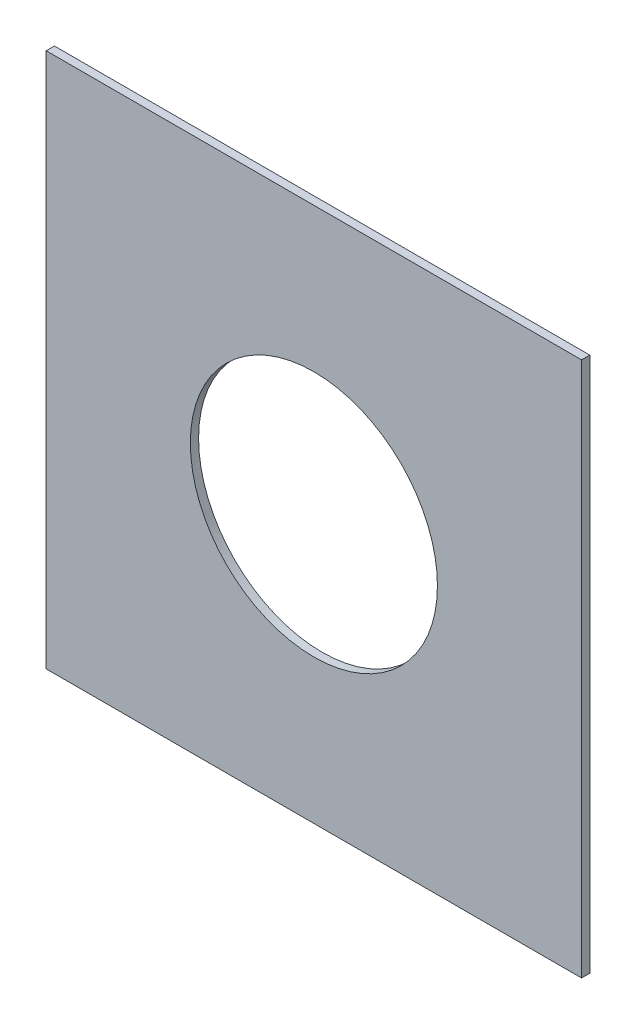
ISO-10303-21;
HEADER;
FILE_DESCRIPTION(('STEP AP214'),'2;1');
FILE_NAME('part.step','',(''),(''),'','','');
FILE_SCHEMA(('AUTOMOTIVE_DESIGN { 1 0 10303 214 1 1 1 1 }'));
ENDSEC;
DATA;
#1=APPLICATION_CONTEXT('core data for automotive mechanical design processes');
#2=APPLICATION_PROTOCOL_DEFINITION('international standard','automotive_design',2000,#1);
#3=PRODUCT_CONTEXT('',#1,'mechanical');
#4=PRODUCT('Part','Part','',(#3));
#5=PRODUCT_RELATED_PRODUCT_CATEGORY('part','',(#4));
#6=PRODUCT_DEFINITION_FORMATION('','',#4);
#7=PRODUCT_DEFINITION_CONTEXT('part definition',#1,'design');
#8=PRODUCT_DEFINITION('design','',#6,#7);
#9=PRODUCT_DEFINITION_SHAPE('','',#8);
#10=(LENGTH_UNIT() NAMED_UNIT(*) SI_UNIT(.MILLI.,.METRE.));
#11=(NAMED_UNIT(*) PLANE_ANGLE_UNIT() SI_UNIT($,.RADIAN.));
#12=(NAMED_UNIT(*) SI_UNIT($,.STERADIAN.) SOLID_ANGLE_UNIT());
#13=UNCERTAINTY_MEASURE_WITH_UNIT(LENGTH_MEASURE(1.E-05),#10,'distance_accuracy_value','');
#14=(GEOMETRIC_REPRESENTATION_CONTEXT(3) GLOBAL_UNCERTAINTY_ASSIGNED_CONTEXT((#13)) GLOBAL_UNIT_ASSIGNED_CONTEXT((#10,
#11,#12)) REPRESENTATION_CONTEXT('',''));
#15=CARTESIAN_POINT('',(0.,0.,0.));
#16=DIRECTION('',(0.,0.,1.));
#17=DIRECTION('',(1.,0.,0.));
#18=AXIS2_PLACEMENT_3D('',#15,#16,#17);
#19=CARTESIAN_POINT('',(-6.776,4.85,-6.999));
#20=DIRECTION('',(0.,1.,0.));
#21=DIRECTION('',(1.,0.,0.));
#22=AXIS2_PLACEMENT_3D('',#19,#20,#21);
#23=PLANE('',#22);
#24=DIRECTION('',(0.,0.,1.));
#25=VECTOR('',#24,1.);
#26=CARTESIAN_POINT('',(-5.475,4.85,-7.01));
#27=LINE('',#26,#25);
#28=CARTESIAN_POINT('',(-5.475,4.85,-7.02));
#29=VERTEX_POINT('',#28);
#30=CARTESIAN_POINT('',(-5.475,4.85,-7.));
#31=VERTEX_POINT('',#30);
#32=EDGE_CURVE('E62',#29,#31,#27,.T.);
#33=ORIENTED_EDGE('',*,*,#32,.F.);
#34=DIRECTION('',(1.,0.,0.));
#35=VECTOR('',#34,1.);
#36=CARTESIAN_POINT('',(-6.125,4.85,-7.02));
#37=LINE('',#36,#35);
#38=CARTESIAN_POINT('',(-6.775,4.85,-7.02));
#39=VERTEX_POINT('',#38);
#40=EDGE_CURVE('E87',#39,#29,#37,.T.);
#41=ORIENTED_EDGE('',*,*,#40,.F.);
#42=DIRECTION('',(0.,0.,-1.));
#43=VECTOR('',#42,1.);
#44=CARTESIAN_POINT('',(-6.775,4.85,-7.01));
#45=LINE('',#44,#43);
#46=CARTESIAN_POINT('',(-6.775,4.85,-7.));
#47=VERTEX_POINT('',#46);
#48=EDGE_CURVE('E73',#47,#39,#45,.T.);
#49=ORIENTED_EDGE('',*,*,#48,.F.);
#50=DIRECTION('',(-1.,0.,0.));
#51=VECTOR('',#50,1.);
#52=CARTESIAN_POINT('',(-6.125,4.85,-7.));
#53=LINE('',#52,#51);
#54=EDGE_CURVE('E56',#31,#47,#53,.T.);
#55=ORIENTED_EDGE('',*,*,#54,.F.);
#56=EDGE_LOOP('',(#33,#41,#49,#55));
#57=FACE_BOUND('',#56,.T.);
#58=ADVANCED_FACE('F17',(#57),#23,.T.);
#59=CARTESIAN_POINT('',(-5.475,4.851,-6.999));
#60=DIRECTION('',(1.,0.,0.));
#61=DIRECTION('',(0.,-1.,0.));
#62=AXIS2_PLACEMENT_3D('',#59,#60,#61);
#63=PLANE('',#62);
#64=DIRECTION('',(0.,0.,-1.));
#65=VECTOR('',#64,1.);
#66=CARTESIAN_POINT('',(-5.475,3.55,-7.01));
#67=LINE('',#66,#65);
#68=CARTESIAN_POINT('',(-5.475,3.55,-7.));
#69=VERTEX_POINT('',#68);
#70=CARTESIAN_POINT('',(-5.475,3.55,-7.02));
#71=VERTEX_POINT('',#70);
#72=EDGE_CURVE('E71',#69,#71,#67,.T.);
#73=ORIENTED_EDGE('',*,*,#72,.T.);
#74=DIRECTION('',(0.,-1.,0.));
#75=VECTOR('',#74,1.);
#76=CARTESIAN_POINT('',(-5.475,4.2,-7.02));
#77=LINE('',#76,#75);
#78=EDGE_CURVE('E67',#29,#71,#77,.T.);
#79=ORIENTED_EDGE('',*,*,#78,.F.);
#80=ORIENTED_EDGE('',*,*,#32,.T.);
#81=DIRECTION('',(0.,1.,0.));
#82=VECTOR('',#81,1.);
#83=CARTESIAN_POINT('',(-5.475,4.2,-7.));
#84=LINE('',#83,#82);
#85=EDGE_CURVE('E64',#69,#31,#84,.T.);
#86=ORIENTED_EDGE('',*,*,#85,.F.);
#87=EDGE_LOOP('',(#73,#79,#80,#86));
#88=FACE_BOUND('',#87,.T.);
#89=ADVANCED_FACE('F63',(#88),#63,.T.);
#90=CARTESIAN_POINT('',(-6.125,4.2,-7.));
#91=DIRECTION('',(0.,0.,-1.));
#92=DIRECTION('',(0.,1.,0.));
#93=AXIS2_PLACEMENT_3D('',#90,#91,#92);
#94=CYLINDRICAL_SURFACE('',#93,0.300000000000001);
#95=CARTESIAN_POINT('',(-6.125,4.2,-7.02));
#96=DIRECTION('',(0.,0.,-1.));
#97=DIRECTION('',(0.,1.,0.));
#98=AXIS2_PLACEMENT_3D('',#95,#96,#97);
#99=CIRCLE('',#98,0.300000000000001);
#100=CARTESIAN_POINT('',(-6.125,4.5,-7.02));
#101=VERTEX_POINT('',#100);
#102=EDGE_CURVE('E82',#101,#101,#99,.F.);
#103=ORIENTED_EDGE('',*,*,#102,.F.);
#104=EDGE_LOOP('',(#103));
#105=FACE_BOUND('',#104,.T.);
#106=CARTESIAN_POINT('',(-6.125,4.2,-7.));
#107=DIRECTION('',(0.,0.,-1.));
#108=DIRECTION('',(0.,1.,0.));
#109=AXIS2_PLACEMENT_3D('',#106,#107,#108);
#110=CIRCLE('',#109,0.300000000000001);
#111=CARTESIAN_POINT('',(-6.125,4.5,-7.));
#112=VERTEX_POINT('',#111);
#113=EDGE_CURVE('E21',#112,#112,#110,.T.);
#114=ORIENTED_EDGE('',*,*,#113,.F.);
#115=EDGE_LOOP('',(#114));
#116=FACE_BOUND('',#115,.T.);
#117=ADVANCED_FACE('F99',(#105,#116),#94,.F.);
#118=CARTESIAN_POINT('',(-5.474,4.851,-7.));
#119=DIRECTION('',(0.,0.,1.));
#120=DIRECTION('',(-1.,0.,0.));
#121=AXIS2_PLACEMENT_3D('',#118,#119,#120);
#122=PLANE('',#121);
#123=ORIENTED_EDGE('',*,*,#113,.T.);
#124=EDGE_LOOP('',(#123));
#125=FACE_BOUND('',#124,.T.);
#126=DIRECTION('',(0.,1.,0.));
#127=VECTOR('',#126,1.);
#128=CARTESIAN_POINT('',(-6.775,4.2,-7.));
#129=LINE('',#128,#127);
#130=CARTESIAN_POINT('',(-6.775,3.55,-7.));
#131=VERTEX_POINT('',#130);
#132=EDGE_CURVE('E94',#131,#47,#129,.T.);
#133=ORIENTED_EDGE('',*,*,#132,.F.);
#134=DIRECTION('',(-1.,0.,0.));
#135=VECTOR('',#134,1.);
#136=CARTESIAN_POINT('',(-6.125,3.55,-7.));
#137=LINE('',#136,#135);
#138=EDGE_CURVE('E78',#69,#131,#137,.T.);
#139=ORIENTED_EDGE('',*,*,#138,.F.);
#140=ORIENTED_EDGE('',*,*,#85,.T.);
#141=ORIENTED_EDGE('',*,*,#54,.T.);
#142=EDGE_LOOP('',(#133,#139,#140,#141));
#143=FACE_BOUND('',#142,.T.);
#144=ADVANCED_FACE('F76',(#125,#143),#122,.T.);
#145=CARTESIAN_POINT('',(-6.775,3.549,-6.999));
#146=DIRECTION('',(-1.,0.,0.));
#147=DIRECTION('',(0.,1.,0.));
#148=AXIS2_PLACEMENT_3D('',#145,#146,#147);
#149=PLANE('',#148);
#150=ORIENTED_EDGE('',*,*,#48,.T.);
#151=DIRECTION('',(0.,1.,0.));
#152=VECTOR('',#151,1.);
#153=CARTESIAN_POINT('',(-6.775,4.2,-7.02));
#154=LINE('',#153,#152);
#155=CARTESIAN_POINT('',(-6.775,3.55,-7.02));
#156=VERTEX_POINT('',#155);
#157=EDGE_CURVE('E36',#156,#39,#154,.T.);
#158=ORIENTED_EDGE('',*,*,#157,.F.);
#159=DIRECTION('',(0.,0.,-1.));
#160=VECTOR('',#159,1.);
#161=CARTESIAN_POINT('',(-6.775,3.55,-7.01));
#162=LINE('',#161,#160);
#163=EDGE_CURVE('E27',#131,#156,#162,.T.);
#164=ORIENTED_EDGE('',*,*,#163,.F.);
#165=ORIENTED_EDGE('',*,*,#132,.T.);
#166=EDGE_LOOP('',(#150,#158,#164,#165));
#167=FACE_BOUND('',#166,.T.);
#168=ADVANCED_FACE('F108',(#167),#149,.T.);
#169=CARTESIAN_POINT('',(-6.776,4.851,-7.02));
#170=DIRECTION('',(0.,0.,-1.));
#171=DIRECTION('',(1.,0.,0.));
#172=AXIS2_PLACEMENT_3D('',#169,#170,#171);
#173=PLANE('',#172);
#174=ORIENTED_EDGE('',*,*,#102,.T.);
#175=EDGE_LOOP('',(#174));
#176=FACE_BOUND('',#175,.T.);
#177=ORIENTED_EDGE('',*,*,#40,.T.);
#178=ORIENTED_EDGE('',*,*,#78,.T.);
#179=DIRECTION('',(1.,0.,0.));
#180=VECTOR('',#179,1.);
#181=CARTESIAN_POINT('',(-6.125,3.55,-7.02));
#182=LINE('',#181,#180);
#183=EDGE_CURVE('E11',#156,#71,#182,.T.);
#184=ORIENTED_EDGE('',*,*,#183,.F.);
#185=ORIENTED_EDGE('',*,*,#157,.T.);
#186=EDGE_LOOP('',(#177,#178,#184,#185));
#187=FACE_BOUND('',#186,.T.);
#188=ADVANCED_FACE('F112',(#176,#187),#173,.T.);
#189=CARTESIAN_POINT('',(-5.474,3.55,-6.999));
#190=DIRECTION('',(0.,-1.,0.));
#191=DIRECTION('',(-1.,0.,0.));
#192=AXIS2_PLACEMENT_3D('',#189,#190,#191);
#193=PLANE('',#192);
#194=ORIENTED_EDGE('',*,*,#163,.T.);
#195=ORIENTED_EDGE('',*,*,#183,.T.);
#196=ORIENTED_EDGE('',*,*,#72,.F.);
#197=ORIENTED_EDGE('',*,*,#138,.T.);
#198=EDGE_LOOP('',(#194,#195,#196,#197));
#199=FACE_BOUND('',#198,.T.);
#200=ADVANCED_FACE('F19',(#199),#193,.T.);
#201=CLOSED_SHELL('',(#58,#89,#117,#144,#168,#188,#200));
#202=MANIFOLD_SOLID_BREP('B1',#201);
#203=ADVANCED_BREP_SHAPE_REPRESENTATION('',(#18,#202),#14);
#204=SHAPE_DEFINITION_REPRESENTATION(#9,#203);
ENDSEC;
END-ISO-10303-21;
